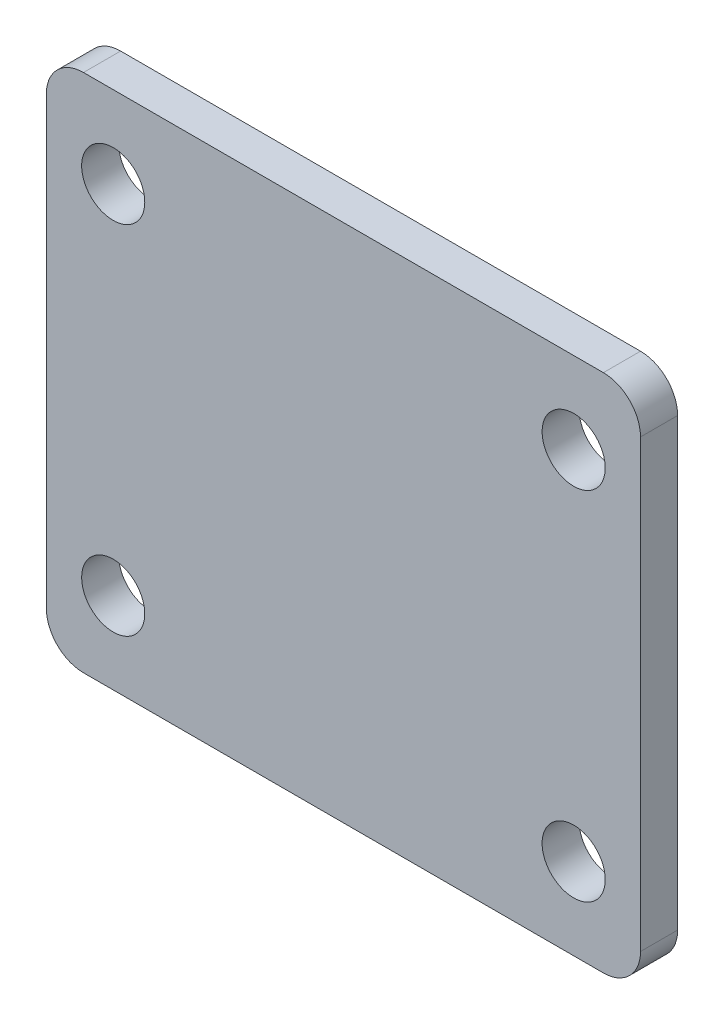
ISO-10303-21;
HEADER;
FILE_DESCRIPTION(('STEP AP214'),'2;1');
FILE_NAME('part.step','',(''),(''),'','','');
FILE_SCHEMA(('AUTOMOTIVE_DESIGN { 1 0 10303 214 1 1 1 1 }'));
ENDSEC;
DATA;
#1=APPLICATION_CONTEXT('core data for automotive mechanical design processes');
#2=APPLICATION_PROTOCOL_DEFINITION('international standard','automotive_design',2000,#1);
#3=PRODUCT_CONTEXT('',#1,'mechanical');
#4=PRODUCT('Part','Part','',(#3));
#5=PRODUCT_RELATED_PRODUCT_CATEGORY('part','',(#4));
#6=PRODUCT_DEFINITION_FORMATION('','',#4);
#7=PRODUCT_DEFINITION_CONTEXT('part definition',#1,'design');
#8=PRODUCT_DEFINITION('design','',#6,#7);
#9=PRODUCT_DEFINITION_SHAPE('','',#8);
#10=(LENGTH_UNIT() NAMED_UNIT(*) SI_UNIT(.MILLI.,.METRE.));
#11=(NAMED_UNIT(*) PLANE_ANGLE_UNIT() SI_UNIT($,.RADIAN.));
#12=(NAMED_UNIT(*) SI_UNIT($,.STERADIAN.) SOLID_ANGLE_UNIT());
#13=UNCERTAINTY_MEASURE_WITH_UNIT(LENGTH_MEASURE(1.E-05),#10,'distance_accuracy_value','');
#14=(GEOMETRIC_REPRESENTATION_CONTEXT(3) GLOBAL_UNCERTAINTY_ASSIGNED_CONTEXT((#13)) GLOBAL_UNIT_ASSIGNED_CONTEXT((#10,
#11,#12)) REPRESENTATION_CONTEXT('',''));
#15=CARTESIAN_POINT('',(0.,0.,0.));
#16=DIRECTION('',(0.,0.,1.));
#17=DIRECTION('',(1.,0.,0.));
#18=AXIS2_PLACEMENT_3D('',#15,#16,#17);
#19=CARTESIAN_POINT('',(80.,-70.,-10.));
#20=DIRECTION('',(1.,0.,0.));
#21=DIRECTION('',(0.,0.,-1.));
#22=AXIS2_PLACEMENT_3D('',#19,#20,#21);
#23=PLANE('',#22);
#24=DIRECTION('',(0.,1.,0.));
#25=VECTOR('',#24,1.);
#26=CARTESIAN_POINT('',(80.,-70.,0.));
#27=LINE('',#26,#25);
#28=CARTESIAN_POINT('',(80.,-60.,0.));
#29=VERTEX_POINT('',#28);
#30=CARTESIAN_POINT('',(80.,60.,0.));
#31=VERTEX_POINT('',#30);
#32=EDGE_CURVE('E188',#29,#31,#27,.T.);
#33=ORIENTED_EDGE('',*,*,#32,.F.);
#34=DIRECTION('',(0.,0.,1.));
#35=VECTOR('',#34,1.);
#36=CARTESIAN_POINT('',(80.,-60.,-10.));
#37=LINE('',#36,#35);
#38=CARTESIAN_POINT('',(80.,-60.,-10.));
#39=VERTEX_POINT('',#38);
#40=EDGE_CURVE('E170',#29,#39,#37,.F.);
#41=ORIENTED_EDGE('',*,*,#40,.T.);
#42=DIRECTION('',(0.,1.,0.));
#43=VECTOR('',#42,1.);
#44=CARTESIAN_POINT('',(80.,-70.,-10.));
#45=LINE('',#44,#43);
#46=CARTESIAN_POINT('',(80.,60.,-10.));
#47=VERTEX_POINT('',#46);
#48=EDGE_CURVE('E178',#39,#47,#45,.T.);
#49=ORIENTED_EDGE('',*,*,#48,.T.);
#50=DIRECTION('',(0.,0.,1.));
#51=VECTOR('',#50,1.);
#52=CARTESIAN_POINT('',(80.,60.,-10.));
#53=LINE('',#52,#51);
#54=EDGE_CURVE('E166',#47,#31,#53,.T.);
#55=ORIENTED_EDGE('',*,*,#54,.T.);
#56=EDGE_LOOP('',(#33,#41,#49,#55));
#57=FACE_BOUND('',#56,.T.);
#58=ADVANCED_FACE('F40',(#57),#23,.T.);
#59=CARTESIAN_POINT('',(-80.,-70.,-10.));
#60=DIRECTION('',(0.,-1.,0.));
#61=DIRECTION('',(0.,0.,-1.));
#62=AXIS2_PLACEMENT_3D('',#59,#60,#61);
#63=PLANE('',#62);
#64=DIRECTION('',(1.,0.,0.));
#65=VECTOR('',#64,1.);
#66=CARTESIAN_POINT('',(-80.,-70.,0.));
#67=LINE('',#66,#65);
#68=CARTESIAN_POINT('',(-70.,-70.,0.));
#69=VERTEX_POINT('',#68);
#70=CARTESIAN_POINT('',(70.,-70.,0.));
#71=VERTEX_POINT('',#70);
#72=EDGE_CURVE('E126',#69,#71,#67,.T.);
#73=ORIENTED_EDGE('',*,*,#72,.F.);
#74=DIRECTION('',(0.,0.,1.));
#75=VECTOR('',#74,1.);
#76=CARTESIAN_POINT('',(-70.,-70.,-10.));
#77=LINE('',#76,#75);
#78=CARTESIAN_POINT('',(-70.,-70.,-10.));
#79=VERTEX_POINT('',#78);
#80=EDGE_CURVE('E152',#69,#79,#77,.F.);
#81=ORIENTED_EDGE('',*,*,#80,.T.);
#82=DIRECTION('',(1.,0.,0.));
#83=VECTOR('',#82,1.);
#84=CARTESIAN_POINT('',(-80.,-70.,-10.));
#85=LINE('',#84,#83);
#86=CARTESIAN_POINT('',(70.,-70.,-10.));
#87=VERTEX_POINT('',#86);
#88=EDGE_CURVE('E129',#79,#87,#85,.T.);
#89=ORIENTED_EDGE('',*,*,#88,.T.);
#90=DIRECTION('',(0.,0.,1.));
#91=VECTOR('',#90,1.);
#92=CARTESIAN_POINT('',(70.,-70.,-10.));
#93=LINE('',#92,#91);
#94=EDGE_CURVE('E148',#87,#71,#93,.T.);
#95=ORIENTED_EDGE('',*,*,#94,.T.);
#96=EDGE_LOOP('',(#73,#81,#89,#95));
#97=FACE_BOUND('',#96,.T.);
#98=ADVANCED_FACE('F241',(#97),#63,.T.);
#99=CARTESIAN_POINT('',(-80.,-70.,-10.));
#100=DIRECTION('',(-1.,0.,0.));
#101=DIRECTION('',(0.,0.,1.));
#102=AXIS2_PLACEMENT_3D('',#99,#100,#101);
#103=PLANE('',#102);
#104=DIRECTION('',(0.,-1.,0.));
#105=VECTOR('',#104,1.);
#106=CARTESIAN_POINT('',(-80.,-70.,-10.));
#107=LINE('',#106,#105);
#108=CARTESIAN_POINT('',(-80.,60.,-10.));
#109=VERTEX_POINT('',#108);
#110=CARTESIAN_POINT('',(-80.,-60.,-10.));
#111=VERTEX_POINT('',#110);
#112=EDGE_CURVE('E136',#109,#111,#107,.T.);
#113=ORIENTED_EDGE('',*,*,#112,.T.);
#114=DIRECTION('',(0.,0.,1.));
#115=VECTOR('',#114,1.);
#116=CARTESIAN_POINT('',(-80.,-60.,-10.));
#117=LINE('',#116,#115);
#118=CARTESIAN_POINT('',(-80.,-60.,0.));
#119=VERTEX_POINT('',#118);
#120=EDGE_CURVE('E117',#111,#119,#117,.T.);
#121=ORIENTED_EDGE('',*,*,#120,.T.);
#122=DIRECTION('',(0.,-1.,0.));
#123=VECTOR('',#122,1.);
#124=CARTESIAN_POINT('',(-80.,-70.,0.));
#125=LINE('',#124,#123);
#126=CARTESIAN_POINT('',(-80.,60.,0.));
#127=VERTEX_POINT('',#126);
#128=EDGE_CURVE('E109',#127,#119,#125,.T.);
#129=ORIENTED_EDGE('',*,*,#128,.F.);
#130=DIRECTION('',(0.,0.,1.));
#131=VECTOR('',#130,1.);
#132=CARTESIAN_POINT('',(-80.,60.,-10.));
#133=LINE('',#132,#131);
#134=EDGE_CURVE('E123',#127,#109,#133,.F.);
#135=ORIENTED_EDGE('',*,*,#134,.T.);
#136=EDGE_LOOP('',(#113,#121,#129,#135));
#137=FACE_BOUND('',#136,.T.);
#138=ADVANCED_FACE('F122',(#137),#103,.T.);
#139=CARTESIAN_POINT('',(-80.,70.,-10.));
#140=DIRECTION('',(0.,1.,0.));
#141=DIRECTION('',(0.,0.,1.));
#142=AXIS2_PLACEMENT_3D('',#139,#140,#141);
#143=PLANE('',#142);
#144=DIRECTION('',(-1.,0.,0.));
#145=VECTOR('',#144,1.);
#146=CARTESIAN_POINT('',(-80.,70.,0.));
#147=LINE('',#146,#145);
#148=CARTESIAN_POINT('',(70.,70.,0.));
#149=VERTEX_POINT('',#148);
#150=CARTESIAN_POINT('',(-70.,70.,0.));
#151=VERTEX_POINT('',#150);
#152=EDGE_CURVE('E110',#149,#151,#147,.T.);
#153=ORIENTED_EDGE('',*,*,#152,.F.);
#154=DIRECTION('',(0.,0.,1.));
#155=VECTOR('',#154,1.);
#156=CARTESIAN_POINT('',(70.,70.,-10.));
#157=LINE('',#156,#155);
#158=CARTESIAN_POINT('',(70.,70.,-10.));
#159=VERTEX_POINT('',#158);
#160=EDGE_CURVE('E11',#149,#159,#157,.F.);
#161=ORIENTED_EDGE('',*,*,#160,.T.);
#162=DIRECTION('',(-1.,0.,0.));
#163=VECTOR('',#162,1.);
#164=CARTESIAN_POINT('',(-80.,70.,-10.));
#165=LINE('',#164,#163);
#166=CARTESIAN_POINT('',(-70.,70.,-10.));
#167=VERTEX_POINT('',#166);
#168=EDGE_CURVE('E176',#159,#167,#165,.T.);
#169=ORIENTED_EDGE('',*,*,#168,.T.);
#170=DIRECTION('',(0.,0.,1.));
#171=VECTOR('',#170,1.);
#172=CARTESIAN_POINT('',(-70.,70.,-10.));
#173=LINE('',#172,#171);
#174=EDGE_CURVE('E49',#167,#151,#173,.T.);
#175=ORIENTED_EDGE('',*,*,#174,.T.);
#176=EDGE_LOOP('',(#153,#161,#169,#175));
#177=FACE_BOUND('',#176,.T.);
#178=ADVANCED_FACE('F175',(#177),#143,.T.);
#179=CARTESIAN_POINT('',(0.,0.,-10.));
#180=DIRECTION('',(0.,0.,-1.));
#181=DIRECTION('',(-1.,0.,0.));
#182=AXIS2_PLACEMENT_3D('',#179,#180,#181);
#183=PLANE('',#182);
#184=CARTESIAN_POINT('',(-62.,-48.,-10.));
#185=DIRECTION('',(0.,0.,1.));
#186=DIRECTION('',(-1.,0.,0.));
#187=AXIS2_PLACEMENT_3D('',#184,#185,#186);
#188=CIRCLE('',#187,8.5);
#189=CARTESIAN_POINT('',(-70.5,-48.,-10.));
#190=VERTEX_POINT('',#189);
#191=EDGE_CURVE('E224',#190,#190,#188,.T.);
#192=ORIENTED_EDGE('',*,*,#191,.T.);
#193=EDGE_LOOP('',(#192));
#194=FACE_BOUND('',#193,.T.);
#195=CARTESIAN_POINT('',(62.,-48.,-10.));
#196=DIRECTION('',(0.,0.,1.));
#197=DIRECTION('',(1.,0.,0.));
#198=AXIS2_PLACEMENT_3D('',#195,#196,#197);
#199=CIRCLE('',#198,8.5);
#200=CARTESIAN_POINT('',(70.5,-48.,-10.));
#201=VERTEX_POINT('',#200);
#202=EDGE_CURVE('E214',#201,#201,#199,.T.);
#203=ORIENTED_EDGE('',*,*,#202,.T.);
#204=EDGE_LOOP('',(#203));
#205=FACE_BOUND('',#204,.T.);
#206=CARTESIAN_POINT('',(62.,48.,-10.));
#207=DIRECTION('',(0.,0.,1.));
#208=DIRECTION('',(-1.,0.,0.));
#209=AXIS2_PLACEMENT_3D('',#206,#207,#208);
#210=CIRCLE('',#209,8.5);
#211=CARTESIAN_POINT('',(53.5,48.,-10.));
#212=VERTEX_POINT('',#211);
#213=EDGE_CURVE('E205',#212,#212,#210,.T.);
#214=ORIENTED_EDGE('',*,*,#213,.T.);
#215=EDGE_LOOP('',(#214));
#216=FACE_BOUND('',#215,.T.);
#217=CARTESIAN_POINT('',(-62.,48.,-10.));
#218=DIRECTION('',(0.,0.,1.));
#219=DIRECTION('',(1.,0.,0.));
#220=AXIS2_PLACEMENT_3D('',#217,#218,#219);
#221=CIRCLE('',#220,8.5);
#222=CARTESIAN_POINT('',(-53.5,48.,-10.));
#223=VERTEX_POINT('',#222);
#224=EDGE_CURVE('E192',#223,#223,#221,.T.);
#225=ORIENTED_EDGE('',*,*,#224,.T.);
#226=EDGE_LOOP('',(#225));
#227=FACE_BOUND('',#226,.T.);
#228=ORIENTED_EDGE('',*,*,#88,.F.);
#229=CARTESIAN_POINT('',(-70.,-60.,-10.));
#230=DIRECTION('',(0.,0.,-1.));
#231=DIRECTION('',(-1.,0.,0.));
#232=AXIS2_PLACEMENT_3D('',#229,#230,#231);
#233=CIRCLE('',#232,10.);
#234=EDGE_CURVE('E163',#79,#111,#233,.T.);
#235=ORIENTED_EDGE('',*,*,#234,.T.);
#236=ORIENTED_EDGE('',*,*,#112,.F.);
#237=CARTESIAN_POINT('',(-70.,60.,-10.));
#238=DIRECTION('',(0.,0.,-1.));
#239=DIRECTION('',(-1.,0.,0.));
#240=AXIS2_PLACEMENT_3D('',#237,#238,#239);
#241=CIRCLE('',#240,10.);
#242=EDGE_CURVE('E56',#109,#167,#241,.T.);
#243=ORIENTED_EDGE('',*,*,#242,.T.);
#244=ORIENTED_EDGE('',*,*,#168,.F.);
#245=CARTESIAN_POINT('',(70.,60.,-10.));
#246=DIRECTION('',(0.,0.,-1.));
#247=DIRECTION('',(-1.,0.,0.));
#248=AXIS2_PLACEMENT_3D('',#245,#246,#247);
#249=CIRCLE('',#248,10.);
#250=EDGE_CURVE('E157',#159,#47,#249,.T.);
#251=ORIENTED_EDGE('',*,*,#250,.T.);
#252=ORIENTED_EDGE('',*,*,#48,.F.);
#253=CARTESIAN_POINT('',(70.,-60.,-10.));
#254=DIRECTION('',(0.,0.,-1.));
#255=DIRECTION('',(-1.,0.,0.));
#256=AXIS2_PLACEMENT_3D('',#253,#254,#255);
#257=CIRCLE('',#256,10.);
#258=EDGE_CURVE('E160',#39,#87,#257,.T.);
#259=ORIENTED_EDGE('',*,*,#258,.T.);
#260=EDGE_LOOP('',(#228,#235,#236,#243,#244,#251,#252,#259));
#261=FACE_BOUND('',#260,.T.);
#262=ADVANCED_FACE('F247',(#194,#205,#216,#227,#261),#183,.T.);
#263=CARTESIAN_POINT('',(0.,0.,0.));
#264=DIRECTION('',(0.,0.,-1.));
#265=DIRECTION('',(-1.,0.,0.));
#266=AXIS2_PLACEMENT_3D('',#263,#264,#265);
#267=PLANE('',#266);
#268=CARTESIAN_POINT('',(-62.,-48.,0.));
#269=DIRECTION('',(0.,0.,1.));
#270=DIRECTION('',(-1.,0.,0.));
#271=AXIS2_PLACEMENT_3D('',#268,#269,#270);
#272=CIRCLE('',#271,8.5);
#273=CARTESIAN_POINT('',(-70.5,-48.,0.));
#274=VERTEX_POINT('',#273);
#275=EDGE_CURVE('E229',#274,#274,#272,.T.);
#276=ORIENTED_EDGE('',*,*,#275,.F.);
#277=EDGE_LOOP('',(#276));
#278=FACE_BOUND('',#277,.T.);
#279=CARTESIAN_POINT('',(62.,-48.,0.));
#280=DIRECTION('',(0.,0.,1.));
#281=DIRECTION('',(1.,0.,0.));
#282=AXIS2_PLACEMENT_3D('',#279,#280,#281);
#283=CIRCLE('',#282,8.5);
#284=CARTESIAN_POINT('',(70.5,-48.,0.));
#285=VERTEX_POINT('',#284);
#286=EDGE_CURVE('E219',#285,#285,#283,.T.);
#287=ORIENTED_EDGE('',*,*,#286,.F.);
#288=EDGE_LOOP('',(#287));
#289=FACE_BOUND('',#288,.T.);
#290=CARTESIAN_POINT('',(62.,48.,0.));
#291=DIRECTION('',(0.,0.,1.));
#292=DIRECTION('',(-1.,0.,0.));
#293=AXIS2_PLACEMENT_3D('',#290,#291,#292);
#294=CIRCLE('',#293,8.5);
#295=CARTESIAN_POINT('',(53.5,48.,0.));
#296=VERTEX_POINT('',#295);
#297=EDGE_CURVE('E209',#296,#296,#294,.T.);
#298=ORIENTED_EDGE('',*,*,#297,.F.);
#299=EDGE_LOOP('',(#298));
#300=FACE_BOUND('',#299,.T.);
#301=CARTESIAN_POINT('',(-62.,48.,0.));
#302=DIRECTION('',(0.,0.,1.));
#303=DIRECTION('',(1.,0.,0.));
#304=AXIS2_PLACEMENT_3D('',#301,#302,#303);
#305=CIRCLE('',#304,8.5);
#306=CARTESIAN_POINT('',(-53.5,48.,0.));
#307=VERTEX_POINT('',#306);
#308=EDGE_CURVE('E200',#307,#307,#305,.T.);
#309=ORIENTED_EDGE('',*,*,#308,.F.);
#310=EDGE_LOOP('',(#309));
#311=FACE_BOUND('',#310,.T.);
#312=ORIENTED_EDGE('',*,*,#128,.T.);
#313=CARTESIAN_POINT('',(-70.,-60.,0.));
#314=DIRECTION('',(0.,0.,-1.));
#315=DIRECTION('',(-1.,0.,0.));
#316=AXIS2_PLACEMENT_3D('',#313,#314,#315);
#317=CIRCLE('',#316,10.);
#318=EDGE_CURVE('E145',#119,#69,#317,.F.);
#319=ORIENTED_EDGE('',*,*,#318,.T.);
#320=ORIENTED_EDGE('',*,*,#72,.T.);
#321=CARTESIAN_POINT('',(70.,-60.,0.));
#322=DIRECTION('',(0.,0.,-1.));
#323=DIRECTION('',(-1.,0.,0.));
#324=AXIS2_PLACEMENT_3D('',#321,#322,#323);
#325=CIRCLE('',#324,10.);
#326=EDGE_CURVE('E142',#71,#29,#325,.F.);
#327=ORIENTED_EDGE('',*,*,#326,.T.);
#328=ORIENTED_EDGE('',*,*,#32,.T.);
#329=CARTESIAN_POINT('',(70.,60.,0.));
#330=DIRECTION('',(0.,0.,-1.));
#331=DIRECTION('',(-1.,0.,0.));
#332=AXIS2_PLACEMENT_3D('',#329,#330,#331);
#333=CIRCLE('',#332,10.);
#334=EDGE_CURVE('E116',#31,#149,#333,.F.);
#335=ORIENTED_EDGE('',*,*,#334,.T.);
#336=ORIENTED_EDGE('',*,*,#152,.T.);
#337=CARTESIAN_POINT('',(-70.,60.,0.));
#338=DIRECTION('',(0.,0.,-1.));
#339=DIRECTION('',(-1.,0.,0.));
#340=AXIS2_PLACEMENT_3D('',#337,#338,#339);
#341=CIRCLE('',#340,10.);
#342=EDGE_CURVE('E106',#151,#127,#341,.F.);
#343=ORIENTED_EDGE('',*,*,#342,.T.);
#344=EDGE_LOOP('',(#312,#319,#320,#327,#328,#335,#336,#343));
#345=FACE_BOUND('',#344,.T.);
#346=ADVANCED_FACE('F108',(#278,#289,#300,#311,#345),#267,.F.);
#347=CARTESIAN_POINT('',(-70.,-60.,-10.));
#348=DIRECTION('',(0.,0.,1.));
#349=DIRECTION('',(1.,0.,0.));
#350=AXIS2_PLACEMENT_3D('',#347,#348,#349);
#351=CYLINDRICAL_SURFACE('',#350,10.);
#352=ORIENTED_EDGE('',*,*,#234,.F.);
#353=ORIENTED_EDGE('',*,*,#80,.F.);
#354=ORIENTED_EDGE('',*,*,#318,.F.);
#355=ORIENTED_EDGE('',*,*,#120,.F.);
#356=EDGE_LOOP('',(#352,#353,#354,#355));
#357=FACE_BOUND('',#356,.T.);
#358=ADVANCED_FACE('F246',(#357),#351,.T.);
#359=CARTESIAN_POINT('',(70.,-60.,-10.));
#360=DIRECTION('',(0.,0.,1.));
#361=DIRECTION('',(1.,0.,0.));
#362=AXIS2_PLACEMENT_3D('',#359,#360,#361);
#363=CYLINDRICAL_SURFACE('',#362,10.);
#364=ORIENTED_EDGE('',*,*,#258,.F.);
#365=ORIENTED_EDGE('',*,*,#40,.F.);
#366=ORIENTED_EDGE('',*,*,#326,.F.);
#367=ORIENTED_EDGE('',*,*,#94,.F.);
#368=EDGE_LOOP('',(#364,#365,#366,#367));
#369=FACE_BOUND('',#368,.T.);
#370=ADVANCED_FACE('F251',(#369),#363,.T.);
#371=CARTESIAN_POINT('',(70.,60.,-10.));
#372=DIRECTION('',(0.,0.,1.));
#373=DIRECTION('',(1.,0.,0.));
#374=AXIS2_PLACEMENT_3D('',#371,#372,#373);
#375=CYLINDRICAL_SURFACE('',#374,10.);
#376=ORIENTED_EDGE('',*,*,#250,.F.);
#377=ORIENTED_EDGE('',*,*,#160,.F.);
#378=ORIENTED_EDGE('',*,*,#334,.F.);
#379=ORIENTED_EDGE('',*,*,#54,.F.);
#380=EDGE_LOOP('',(#376,#377,#378,#379));
#381=FACE_BOUND('',#380,.T.);
#382=ADVANCED_FACE('F256',(#381),#375,.T.);
#383=CARTESIAN_POINT('',(-70.,60.,-10.));
#384=DIRECTION('',(0.,0.,1.));
#385=DIRECTION('',(1.,0.,0.));
#386=AXIS2_PLACEMENT_3D('',#383,#384,#385);
#387=CYLINDRICAL_SURFACE('',#386,10.);
#388=ORIENTED_EDGE('',*,*,#242,.F.);
#389=ORIENTED_EDGE('',*,*,#134,.F.);
#390=ORIENTED_EDGE('',*,*,#342,.F.);
#391=ORIENTED_EDGE('',*,*,#174,.F.);
#392=EDGE_LOOP('',(#388,#389,#390,#391));
#393=FACE_BOUND('',#392,.T.);
#394=ADVANCED_FACE('F42',(#393),#387,.T.);
#395=CARTESIAN_POINT('',(-62.,48.,-10.));
#396=DIRECTION('',(0.,0.,1.));
#397=DIRECTION('',(1.,0.,0.));
#398=AXIS2_PLACEMENT_3D('',#395,#396,#397);
#399=CYLINDRICAL_SURFACE('',#398,8.5);
#400=ORIENTED_EDGE('',*,*,#224,.F.);
#401=EDGE_LOOP('',(#400));
#402=FACE_BOUND('',#401,.T.);
#403=ORIENTED_EDGE('',*,*,#308,.T.);
#404=EDGE_LOOP('',(#403));
#405=FACE_BOUND('',#404,.T.);
#406=ADVANCED_FACE('F262',(#402,#405),#399,.F.);
#407=CARTESIAN_POINT('',(62.,48.,-10.));
#408=DIRECTION('',(0.,0.,1.));
#409=DIRECTION('',(1.,0.,0.));
#410=AXIS2_PLACEMENT_3D('',#407,#408,#409);
#411=CYLINDRICAL_SURFACE('',#410,8.5);
#412=ORIENTED_EDGE('',*,*,#213,.F.);
#413=EDGE_LOOP('',(#412));
#414=FACE_BOUND('',#413,.T.);
#415=ORIENTED_EDGE('',*,*,#297,.T.);
#416=EDGE_LOOP('',(#415));
#417=FACE_BOUND('',#416,.T.);
#418=ADVANCED_FACE('F341',(#414,#417),#411,.F.);
#419=CARTESIAN_POINT('',(62.,-48.,-10.));
#420=DIRECTION('',(0.,0.,1.));
#421=DIRECTION('',(1.,0.,0.));
#422=AXIS2_PLACEMENT_3D('',#419,#420,#421);
#423=CYLINDRICAL_SURFACE('',#422,8.5);
#424=ORIENTED_EDGE('',*,*,#202,.F.);
#425=EDGE_LOOP('',(#424));
#426=FACE_BOUND('',#425,.T.);
#427=ORIENTED_EDGE('',*,*,#286,.T.);
#428=EDGE_LOOP('',(#427));
#429=FACE_BOUND('',#428,.T.);
#430=ADVANCED_FACE('F352',(#426,#429),#423,.F.);
#431=CARTESIAN_POINT('',(-62.,-48.,-10.));
#432=DIRECTION('',(0.,0.,1.));
#433=DIRECTION('',(1.,0.,0.));
#434=AXIS2_PLACEMENT_3D('',#431,#432,#433);
#435=CYLINDRICAL_SURFACE('',#434,8.5);
#436=ORIENTED_EDGE('',*,*,#191,.F.);
#437=EDGE_LOOP('',(#436));
#438=FACE_BOUND('',#437,.T.);
#439=ORIENTED_EDGE('',*,*,#275,.T.);
#440=EDGE_LOOP('',(#439));
#441=FACE_BOUND('',#440,.T.);
#442=ADVANCED_FACE('F362',(#438,#441),#435,.F.);
#443=CLOSED_SHELL('',(#58,#98,#138,#178,#262,#346,#358,#370,#382,#394,#406,#418,#430,#442));
#444=MANIFOLD_SOLID_BREP('B2',#443);
#445=ADVANCED_BREP_SHAPE_REPRESENTATION('',(#18,#444),#14);
#446=SHAPE_DEFINITION_REPRESENTATION(#9,#445);
ENDSEC;
END-ISO-10303-21;
